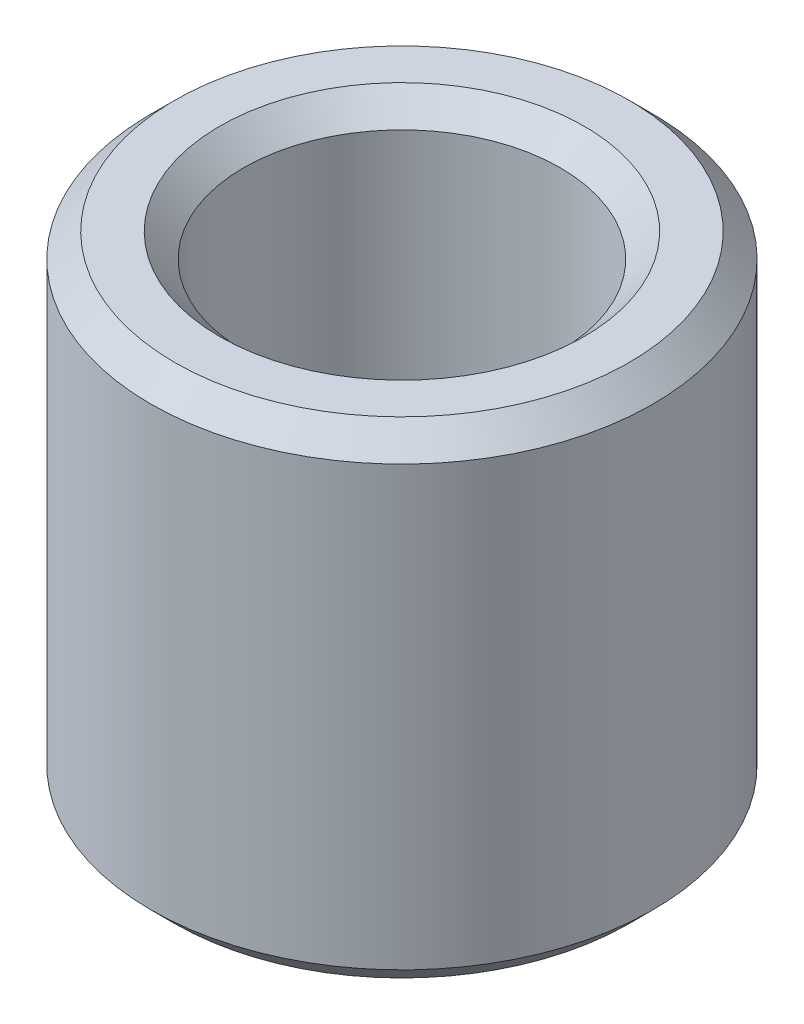
ISO-10303-21;
HEADER;
FILE_DESCRIPTION(('STEP AP214'),'2;1');
FILE_NAME('part.step','',(''),(''),'','','');
FILE_SCHEMA(('AUTOMOTIVE_DESIGN { 1 0 10303 214 1 1 1 1 }'));
ENDSEC;
DATA;
#1=APPLICATION_CONTEXT('core data for automotive mechanical design processes');
#2=APPLICATION_PROTOCOL_DEFINITION('international standard','automotive_design',2000,#1);
#3=PRODUCT_CONTEXT('',#1,'mechanical');
#4=PRODUCT('Part','Part','',(#3));
#5=PRODUCT_RELATED_PRODUCT_CATEGORY('part','',(#4));
#6=PRODUCT_DEFINITION_FORMATION('','',#4);
#7=PRODUCT_DEFINITION_CONTEXT('part definition',#1,'design');
#8=PRODUCT_DEFINITION('design','',#6,#7);
#9=PRODUCT_DEFINITION_SHAPE('','',#8);
#10=(LENGTH_UNIT() NAMED_UNIT(*) SI_UNIT(.MILLI.,.METRE.));
#11=(NAMED_UNIT(*) PLANE_ANGLE_UNIT() SI_UNIT($,.RADIAN.));
#12=(NAMED_UNIT(*) SI_UNIT($,.STERADIAN.) SOLID_ANGLE_UNIT());
#13=UNCERTAINTY_MEASURE_WITH_UNIT(LENGTH_MEASURE(1.E-05),#10,'distance_accuracy_value','');
#14=(GEOMETRIC_REPRESENTATION_CONTEXT(3) GLOBAL_UNCERTAINTY_ASSIGNED_CONTEXT((#13)) GLOBAL_UNIT_ASSIGNED_CONTEXT((#10,
#11,#12)) REPRESENTATION_CONTEXT('',''));
#15=CARTESIAN_POINT('',(0.,0.,0.));
#16=DIRECTION('',(0.,0.,1.));
#17=DIRECTION('',(1.,0.,0.));
#18=AXIS2_PLACEMENT_3D('',#15,#16,#17);
#19=CARTESIAN_POINT('',(0.,14.5131731515781,0.));
#20=DIRECTION('',(0.,-1.,0.));
#21=DIRECTION('',(0.,0.,-1.));
#22=AXIS2_PLACEMENT_3D('',#19,#20,#21);
#23=CYLINDRICAL_SURFACE('',#22,7.5);
#24=CARTESIAN_POINT('',(0.,0.715792673969954,0.));
#25=DIRECTION('',(0.,1.,0.));
#26=DIRECTION('',(0.,0.,1.));
#27=AXIS2_PLACEMENT_3D('',#24,#25,#26);
#28=CIRCLE('',#27,7.5);
#29=CARTESIAN_POINT('',(0.,0.715792673969954,7.5));
#30=VERTEX_POINT('',#29);
#31=EDGE_CURVE('E10',#30,#30,#28,.T.);
#32=ORIENTED_EDGE('',*,*,#31,.T.);
#33=EDGE_LOOP('',(#32));
#34=FACE_BOUND('',#33,.T.);
#35=CARTESIAN_POINT('',(0.,13.7973804776081,0.));
#36=DIRECTION('',(0.,1.,0.));
#37=DIRECTION('',(0.,0.,1.));
#38=AXIS2_PLACEMENT_3D('',#35,#36,#37);
#39=CIRCLE('',#38,7.5);
#40=CARTESIAN_POINT('',(0.,13.7973804776081,7.5));
#41=VERTEX_POINT('',#40);
#42=EDGE_CURVE('E50',#41,#41,#39,.F.);
#43=ORIENTED_EDGE('',*,*,#42,.T.);
#44=EDGE_LOOP('',(#43));
#45=FACE_BOUND('',#44,.T.);
#46=ADVANCED_FACE('F39',(#34,#45),#23,.T.);
#47=CARTESIAN_POINT('',(0.,14.5131731515781,0.));
#48=DIRECTION('',(0.,1.,0.));
#49=DIRECTION('',(0.,0.,1.));
#50=AXIS2_PLACEMENT_3D('',#47,#48,#49);
#51=PLANE('',#50);
#52=CARTESIAN_POINT('',(0.,14.5131731515781,0.));
#53=DIRECTION('',(0.,1.,0.));
#54=DIRECTION('',(0.,0.,1.));
#55=AXIS2_PLACEMENT_3D('',#52,#53,#54);
#56=CIRCLE('',#55,5.44281442834793);
#57=CARTESIAN_POINT('',(0.,14.5131731515781,5.44281442834793));
#58=VERTEX_POINT('',#57);
#59=EDGE_CURVE('E58',#58,#58,#56,.F.);
#60=ORIENTED_EDGE('',*,*,#59,.T.);
#61=EDGE_LOOP('',(#60));
#62=FACE_BOUND('',#61,.T.);
#63=CARTESIAN_POINT('',(0.,14.5131731515781,0.));
#64=DIRECTION('',(0.,1.,0.));
#65=DIRECTION('',(0.,0.,1.));
#66=AXIS2_PLACEMENT_3D('',#63,#64,#65);
#67=CIRCLE('',#66,6.78420732603005);
#68=CARTESIAN_POINT('',(0.,14.5131731515781,6.78420732603005));
#69=VERTEX_POINT('',#68);
#70=EDGE_CURVE('E61',#69,#69,#67,.T.);
#71=ORIENTED_EDGE('',*,*,#70,.T.);
#72=EDGE_LOOP('',(#71));
#73=FACE_BOUND('',#72,.T.);
#74=ADVANCED_FACE('F88',(#62,#73),#51,.T.);
#75=CARTESIAN_POINT('',(0.,0.,0.));
#76=DIRECTION('',(0.,1.,0.));
#77=DIRECTION('',(0.,0.,1.));
#78=AXIS2_PLACEMENT_3D('',#75,#76,#77);
#79=PLANE('',#78);
#80=CARTESIAN_POINT('',(0.,0.,0.));
#81=DIRECTION('',(0.,1.,0.));
#82=DIRECTION('',(0.,0.,1.));
#83=AXIS2_PLACEMENT_3D('',#80,#81,#82);
#84=CIRCLE('',#83,5.44281442834793);
#85=CARTESIAN_POINT('',(0.,0.,5.44281442834793));
#86=VERTEX_POINT('',#85);
#87=EDGE_CURVE('E51',#86,#86,#84,.T.);
#88=ORIENTED_EDGE('',*,*,#87,.T.);
#89=EDGE_LOOP('',(#88));
#90=FACE_BOUND('',#89,.T.);
#91=CARTESIAN_POINT('',(0.,0.,0.));
#92=DIRECTION('',(0.,1.,0.));
#93=DIRECTION('',(0.,0.,1.));
#94=AXIS2_PLACEMENT_3D('',#91,#92,#93);
#95=CIRCLE('',#94,6.78420732603004);
#96=CARTESIAN_POINT('',(0.,0.,6.78420732603004));
#97=VERTEX_POINT('',#96);
#98=EDGE_CURVE('E54',#97,#97,#95,.F.);
#99=ORIENTED_EDGE('',*,*,#98,.T.);
#100=EDGE_LOOP('',(#99));
#101=FACE_BOUND('',#100,.T.);
#102=ADVANCED_FACE('F83',(#90,#101),#79,.F.);
#103=CARTESIAN_POINT('',(0.,14.5131731515781,0.));
#104=DIRECTION('',(0.,-1.,0.));
#105=DIRECTION('',(0.,0.,-1.));
#106=AXIS2_PLACEMENT_3D('',#103,#104,#105);
#107=CYLINDRICAL_SURFACE('',#106,4.72702175437798);
#108=CARTESIAN_POINT('',(0.,13.7973804776081,0.));
#109=DIRECTION('',(0.,1.,0.));
#110=DIRECTION('',(0.,0.,1.));
#111=AXIS2_PLACEMENT_3D('',#108,#109,#110);
#112=CIRCLE('',#111,4.72702175437798);
#113=CARTESIAN_POINT('',(0.,13.7973804776081,4.72702175437797));
#114=VERTEX_POINT('',#113);
#115=EDGE_CURVE('E67',#114,#114,#112,.T.);
#116=ORIENTED_EDGE('',*,*,#115,.T.);
#117=EDGE_LOOP('',(#116));
#118=FACE_BOUND('',#117,.T.);
#119=CARTESIAN_POINT('',(0.,0.715792673969956,0.));
#120=DIRECTION('',(0.,1.,0.));
#121=DIRECTION('',(0.,0.,1.));
#122=AXIS2_PLACEMENT_3D('',#119,#120,#121);
#123=CIRCLE('',#122,4.72702175437798);
#124=CARTESIAN_POINT('',(0.,0.715792673969956,4.72702175437798));
#125=VERTEX_POINT('',#124);
#126=EDGE_CURVE('E69',#125,#125,#123,.F.);
#127=ORIENTED_EDGE('',*,*,#126,.T.);
#128=EDGE_LOOP('',(#127));
#129=FACE_BOUND('',#128,.T.);
#130=ADVANCED_FACE('F71',(#118,#129),#107,.F.);
#131=CARTESIAN_POINT('',(0.,13.7973804776081,0.));
#132=DIRECTION('',(0.,1.,0.));
#133=DIRECTION('',(0.,0.,1.));
#134=AXIS2_PLACEMENT_3D('',#131,#132,#133);
#135=CONICAL_SURFACE('',#134,4.72702175437798,0.785398163397452);
#136=CARTESIAN_POINT('',(0.,14.5131731515781,5.44281442834793));
#137=CARTESIAN_POINT('',(0.,14.5057169778909,5.43535825466075));
#138=CARTESIAN_POINT('',(0.,14.4982608042037,5.42790208097356));
#139=CARTESIAN_POINT('',(0.,14.4833484568293,5.41298973359918));
#140=CARTESIAN_POINT('',(0.,14.4758922831421,5.405533559912));
#141=CARTESIAN_POINT('',(0.,14.4609799357678,5.39062121253762));
#142=CARTESIAN_POINT('',(0.,14.4535237620806,5.38316503885044));
#143=CARTESIAN_POINT('',(0.,14.4386114147062,5.36825269147606));
#144=CARTESIAN_POINT('',(0.,14.431155241019,5.36079651778888));
#145=CARTESIAN_POINT('',(0.,14.4162428936446,5.3458841704145));
#146=CARTESIAN_POINT('',(0.,14.4087867199574,5.33842799672732));
#147=CARTESIAN_POINT('',(0.,14.3938743725831,5.32351564935294));
#148=CARTESIAN_POINT('',(0.,14.3864181988959,5.31605947566575));
#149=CARTESIAN_POINT('',(0.,14.3715058515215,5.30114712829138));
#150=CARTESIAN_POINT('',(0.,14.3640496778343,5.29369095460419));
#151=CARTESIAN_POINT('',(0.,14.34913733046,5.27877860722982));
#152=CARTESIAN_POINT('',(0.,14.3416811567728,5.27132243354263));
#153=CARTESIAN_POINT('',(0.,14.3267688093984,5.25641008616826));
#154=CARTESIAN_POINT('',(0.,14.3193126357112,5.24895391248107));
#155=CARTESIAN_POINT('',(0.,14.3044002883368,5.2340415651067));
#156=CARTESIAN_POINT('',(0.,14.2969441146496,5.22658539141951));
#157=CARTESIAN_POINT('',(0.,14.2820317672753,5.21167304404513));
#158=CARTESIAN_POINT('',(0.,14.2745755935881,5.20421687035795));
#159=CARTESIAN_POINT('',(0.,14.2596632462137,5.18930452298357));
#160=CARTESIAN_POINT('',(0.,14.2522070725265,5.18184834929639));
#161=CARTESIAN_POINT('',(0.,14.2372947251521,5.16693600192201));
#162=CARTESIAN_POINT('',(0.,14.229838551465,5.15947982823482));
#163=CARTESIAN_POINT('',(0.,14.2149262040906,5.14456748086045));
#164=CARTESIAN_POINT('',(0.,14.2074700304034,5.13711130717326));
#165=CARTESIAN_POINT('',(0.,14.192557683029,5.12219895979889));
#166=CARTESIAN_POINT('',(0.,14.1851015093418,5.1147427861117));
#167=CARTESIAN_POINT('',(0.,14.1701891619675,5.09983043873733));
#168=CARTESIAN_POINT('',(0.,14.1627329882803,5.09237426505014));
#169=CARTESIAN_POINT('',(0.,14.1478206409059,5.07746191767577));
#170=CARTESIAN_POINT('',(0.,14.1403644672187,5.07000574398858));
#171=CARTESIAN_POINT('',(0.,14.1254521198443,5.0550933966142));
#172=CARTESIAN_POINT('',(0.,14.1179959461572,5.04763722292702));
#173=CARTESIAN_POINT('',(0.,14.1030835987828,5.03272487555264));
#174=CARTESIAN_POINT('',(0.,14.0956274250956,5.02526870186546));
#175=CARTESIAN_POINT('',(0.,14.0807150777212,5.01035635449108));
#176=CARTESIAN_POINT('',(0.,14.073258904034,5.0029001808039));
#177=CARTESIAN_POINT('',(0.,14.0583465566597,4.98798783342952));
#178=CARTESIAN_POINT('',(0.,14.0508903829725,4.98053165974234));
#179=CARTESIAN_POINT('',(0.,14.0359780355981,4.96561931236796));
#180=CARTESIAN_POINT('',(0.,14.0285218619109,4.95816313868077));
#181=CARTESIAN_POINT('',(0.,14.0136095145365,4.9432507913064));
#182=CARTESIAN_POINT('',(0.,14.0061533408494,4.93579461761921));
#183=CARTESIAN_POINT('',(0.,13.991240993475,4.92088227024484));
#184=CARTESIAN_POINT('',(0.,13.9837848197878,4.91342609655765));
#185=CARTESIAN_POINT('',(0.,13.9688724724134,4.89851374918328));
#186=CARTESIAN_POINT('',(0.,13.9614162987262,4.89105757549609));
#187=CARTESIAN_POINT('',(0.,13.9465039513519,4.87614522812172));
#188=CARTESIAN_POINT('',(0.,13.9390477776647,4.86868905443453));
#189=CARTESIAN_POINT('',(0.,13.9241354302903,4.85377670706016));
#190=CARTESIAN_POINT('',(0.,13.9166792566031,4.84632053337297));
#191=CARTESIAN_POINT('',(0.,13.9017669092287,4.83140818599859));
#192=CARTESIAN_POINT('',(0.,13.8943107355415,4.82395201231141));
#193=CARTESIAN_POINT('',(0.,13.8793983881672,4.80903966493703));
#194=CARTESIAN_POINT('',(0.,13.87194221448,4.80158349124985));
#195=CARTESIAN_POINT('',(0.,13.8570298671056,4.78667114387547));
#196=CARTESIAN_POINT('',(0.,13.8495736934184,4.77921497018828));
#197=CARTESIAN_POINT('',(0.,13.834661346044,4.76430262281391));
#198=CARTESIAN_POINT('',(0.,13.8272051723569,4.75684644912672));
#199=CARTESIAN_POINT('',(0.,13.8122928249825,4.74193410175235));
#200=CARTESIAN_POINT('',(0.,13.8048366512953,4.73447792806516));
#201=CARTESIAN_POINT('',(0.,13.7973804776081,4.72702175437797));
#202=B_SPLINE_CURVE_WITH_KNOTS('',3,(#136,#137,#138,#139,#140,#141,#142,#143,#144,#145,#146,
#147,#148,#149,#150,#151,#152,#153,#154,#155,#156,#157,#158,#159,#160,#161,#162,#163,#164,#165,
#166,#167,#168,#169,#170,#171,#172,#173,#174,#175,#176,#177,#178,#179,#180,#181,#182,#183,#184,
#185,#186,#187,#188,#189,#190,#191,#192,#193,#194,#195,#196,#197,#198,#199,#200,#201),
.UNSPECIFIED.,.F.,.F.,(4,2,2,2,2,2,2,2,2,2,2,2,2,2,2,2,2,2,2,2,2,2,2,2,2,2,2,2,2,2,2,2,4),(0.,
0.0316338658554886,0.0632677317109759,0.0949015975664645,0.126535463421952,0.15816932927744,
0.189803195132928,0.221437060988416,0.253070926843904,0.284704792699392,0.31633865855488,
0.347972524410368,0.379606390265856,0.411240256121344,0.442874121976832,0.474507987832319,
0.506141853687807,0.537775719543296,0.569409585398783,0.601043451254272,0.632677317109759,
0.664311182965248,0.695945048820735,0.727578914676224,0.759212780531711,0.790846646387198,
0.822480512242687,0.854114378098175,0.885748243953663,0.917382109809151,0.949015975664639,
0.980649841520127,1.01228370737561),.UNSPECIFIED.);
#203=EDGE_CURVE('BSEAM77',#58,#114,#202,.T.);
#204=ORIENTED_EDGE('',*,*,#59,.F.);
#205=ORIENTED_EDGE('',*,*,#115,.F.);
#206=ORIENTED_EDGE('',*,*,#203,.T.);
#207=ORIENTED_EDGE('',*,*,#203,.F.);
#208=EDGE_LOOP('',(#204,#206,#205,#207));
#209=FACE_BOUND('',#208,.T.);
#210=ADVANCED_FACE('F77',(#209),#135,.F.);
#211=CARTESIAN_POINT('',(0.,0.,0.));
#212=DIRECTION('',(0.,-1.,0.));
#213=DIRECTION('',(0.,0.,-1.));
#214=AXIS2_PLACEMENT_3D('',#211,#212,#213);
#215=CONICAL_SURFACE('',#214,5.44281442834793,0.785398163397445);
#216=ORIENTED_EDGE('',*,*,#126,.F.);
#217=EDGE_LOOP('',(#216));
#218=FACE_BOUND('',#217,.T.);
#219=ORIENTED_EDGE('',*,*,#87,.F.);
#220=EDGE_LOOP('',(#219));
#221=FACE_BOUND('',#220,.T.);
#222=ADVANCED_FACE('F73',(#218,#221),#215,.F.);
#223=CARTESIAN_POINT('',(0.,0.715792673969954,0.));
#224=DIRECTION('',(0.,1.,0.));
#225=DIRECTION('',(0.,0.,1.));
#226=AXIS2_PLACEMENT_3D('',#223,#224,#225);
#227=CONICAL_SURFACE('',#226,7.5,0.785398163397452);
#228=CARTESIAN_POINT('',(0.,0.,6.78420732603004));
#229=CARTESIAN_POINT('',(0.,0.00745617368718697,6.79166349971723));
#230=CARTESIAN_POINT('',(0.,0.014912347374374,6.79911967340441));
#231=CARTESIAN_POINT('',(0.,0.029824694748748,6.81403202077879));
#232=CARTESIAN_POINT('',(0.,0.037280868435935,6.82148819446598));
#233=CARTESIAN_POINT('',(0.,0.0521932158103091,6.83640054184035));
#234=CARTESIAN_POINT('',(0.,0.0596493894974961,6.84385671552754));
#235=CARTESIAN_POINT('',(0.,0.0745617368718702,6.85876906290191));
#236=CARTESIAN_POINT('',(0.,0.0820179105590571,6.8662252365891));
#237=CARTESIAN_POINT('',(0.,0.0969302579334312,6.88113758396347));
#238=CARTESIAN_POINT('',(0.,0.104386431620618,6.88859375765066));
#239=CARTESIAN_POINT('',(0.,0.119298778994992,6.90350610502503));
#240=CARTESIAN_POINT('',(0.,0.126754952682179,6.91096227871222));
#241=CARTESIAN_POINT('',(0.,0.141667300056553,6.9258746260866));
#242=CARTESIAN_POINT('',(0.,0.14912347374374,6.93333079977378));
#243=CARTESIAN_POINT('',(0.,0.164035821118114,6.94824314714816));
#244=CARTESIAN_POINT('',(0.,0.171491994805301,6.95569932083534));
#245=CARTESIAN_POINT('',(0.,0.186404342179675,6.97061166820972));
#246=CARTESIAN_POINT('',(0.,0.193860515866863,6.9780678418969));
#247=CARTESIAN_POINT('',(0.,0.208772863241237,6.99298018927128));
#248=CARTESIAN_POINT('',(0.,0.216229036928424,7.00043636295846));
#249=CARTESIAN_POINT('',(0.,0.231141384302798,7.01534871033284));
#250=CARTESIAN_POINT('',(0.,0.238597557989985,7.02280488402003));
#251=CARTESIAN_POINT('',(0.,0.253509905364359,7.0377172313944));
#252=CARTESIAN_POINT('',(0.,0.260966079051546,7.04517340508159));
#253=CARTESIAN_POINT('',(0.,0.27587842642592,7.06008575245596));
#254=CARTESIAN_POINT('',(0.,0.283334600113107,7.06754192614315));
#255=CARTESIAN_POINT('',(0.,0.298246947487481,7.08245427351752));
#256=CARTESIAN_POINT('',(0.,0.305703121174668,7.08991044720471));
#257=CARTESIAN_POINT('',(0.,0.320615468549042,7.10482279457908));
#258=CARTESIAN_POINT('',(0.,0.328071642236229,7.11227896826627));
#259=CARTESIAN_POINT('',(0.,0.342983989610603,7.12719131564065));
#260=CARTESIAN_POINT('',(0.,0.35044016329779,7.13464748932783));
#261=CARTESIAN_POINT('',(0.,0.365352510672164,7.14955983670221));
#262=CARTESIAN_POINT('',(0.,0.372808684359351,7.15701601038939));
#263=CARTESIAN_POINT('',(0.,0.387721031733725,7.17192835776377));
#264=CARTESIAN_POINT('',(0.,0.395177205420912,7.17938453145096));
#265=CARTESIAN_POINT('',(0.,0.410089552795286,7.19429687882533));
#266=CARTESIAN_POINT('',(0.,0.417545726482473,7.20175305251252));
#267=CARTESIAN_POINT('',(0.,0.432458073856847,7.21666539988689));
#268=CARTESIAN_POINT('',(0.,0.439914247544034,7.22412157357408));
#269=CARTESIAN_POINT('',(0.,0.454826594918408,7.23903392094845));
#270=CARTESIAN_POINT('',(0.,0.462282768605595,7.24649009463564));
#271=CARTESIAN_POINT('',(0.,0.477195115979969,7.26140244201001));
#272=CARTESIAN_POINT('',(0.,0.484651289667156,7.2688586156972));
#273=CARTESIAN_POINT('',(0.,0.499563637041531,7.28377096307158));
#274=CARTESIAN_POINT('',(0.,0.507019810728718,7.29122713675876));
#275=CARTESIAN_POINT('',(0.,0.521932158103092,7.30613948413314));
#276=CARTESIAN_POINT('',(0.,0.529388331790279,7.31359565782032));
#277=CARTESIAN_POINT('',(0.,0.544300679164653,7.3285080051947));
#278=CARTESIAN_POINT('',(0.,0.55175685285184,7.33596417888188));
#279=CARTESIAN_POINT('',(0.,0.566669200226214,7.35087652625626));
#280=CARTESIAN_POINT('',(0.,0.574125373913401,7.35833269994344));
#281=CARTESIAN_POINT('',(0.,0.589037721287775,7.37324504731782));
#282=CARTESIAN_POINT('',(0.,0.596493894974962,7.38070122100501));
#283=CARTESIAN_POINT('',(0.,0.611406242349336,7.39561356837938));
#284=CARTESIAN_POINT('',(0.,0.618862416036523,7.40306974206657));
#285=CARTESIAN_POINT('',(0.,0.633774763410897,7.41798208944094));
#286=CARTESIAN_POINT('',(0.,0.641230937098084,7.42543826312813));
#287=CARTESIAN_POINT('',(0.,0.656143284472458,7.4403506105025));
#288=CARTESIAN_POINT('',(0.,0.663599458159645,7.44780678418969));
#289=CARTESIAN_POINT('',(0.,0.678511805534019,7.46271913156406));
#290=CARTESIAN_POINT('',(0.,0.685967979221206,7.47017530525125));
#291=CARTESIAN_POINT('',(0.,0.70088032659558,7.48508765262563));
#292=CARTESIAN_POINT('',(0.,0.708336500282767,7.49254382631281));
#293=CARTESIAN_POINT('',(0.,0.715792673969954,7.5));
#294=B_SPLINE_CURVE_WITH_KNOTS('',3,(#228,#229,#230,#231,#232,#233,#234,#235,#236,#237,#238,
#239,#240,#241,#242,#243,#244,#245,#246,#247,#248,#249,#250,#251,#252,#253,#254,#255,#256,#257,
#258,#259,#260,#261,#262,#263,#264,#265,#266,#267,#268,#269,#270,#271,#272,#273,#274,#275,#276,
#277,#278,#279,#280,#281,#282,#283,#284,#285,#286,#287,#288,#289,#290,#291,#292,#293),
.UNSPECIFIED.,.F.,.F.,(4,2,2,2,2,2,2,2,2,2,2,2,2,2,2,2,2,2,2,2,2,2,2,2,2,2,2,2,2,2,2,2,4),(0.,
0.031633865855488,0.0632677317109759,0.0949015975664638,0.126535463421952,0.15816932927744,
0.189803195132928,0.221437060988416,0.253070926843904,0.284704792699392,0.31633865855488,
0.347972524410368,0.379606390265856,0.411240256121344,0.442874121976832,0.47450798783232,
0.506141853687808,0.537775719543296,0.569409585398784,0.601043451254272,0.63267731710976,
0.664311182965248,0.695945048820736,0.727578914676224,0.759212780531712,0.7908466463872,
0.822480512242688,0.854114378098176,0.885748243953664,0.917382109809152,0.94901597566464,
0.980649841520128,1.01228370737562),.UNSPECIFIED.);
#295=EDGE_CURVE('BSEAM76',#97,#30,#294,.T.);
#296=ORIENTED_EDGE('',*,*,#98,.F.);
#297=ORIENTED_EDGE('',*,*,#31,.F.);
#298=ORIENTED_EDGE('',*,*,#295,.T.);
#299=ORIENTED_EDGE('',*,*,#295,.F.);
#300=EDGE_LOOP('',(#296,#298,#297,#299));
#301=FACE_BOUND('',#300,.T.);
#302=ADVANCED_FACE('F76',(#301),#227,.T.);
#303=CARTESIAN_POINT('',(0.,14.5131731515781,0.));
#304=DIRECTION('',(0.,-1.,0.));
#305=DIRECTION('',(0.,0.,-1.));
#306=AXIS2_PLACEMENT_3D('',#303,#304,#305);
#307=CONICAL_SURFACE('',#306,6.78420732603005,0.785398163397445);
#308=ORIENTED_EDGE('',*,*,#42,.F.);
#309=EDGE_LOOP('',(#308));
#310=FACE_BOUND('',#309,.T.);
#311=ORIENTED_EDGE('',*,*,#70,.F.);
#312=EDGE_LOOP('',(#311));
#313=FACE_BOUND('',#312,.T.);
#314=ADVANCED_FACE('F45',(#310,#313),#307,.T.);
#315=CLOSED_SHELL('',(#46,#74,#102,#130,#210,#222,#302,#314));
#316=MANIFOLD_SOLID_BREP('B2',#315);
#317=ADVANCED_BREP_SHAPE_REPRESENTATION('',(#18,#316),#14);
#318=SHAPE_DEFINITION_REPRESENTATION(#9,#317);
ENDSEC;
END-ISO-10303-21;
